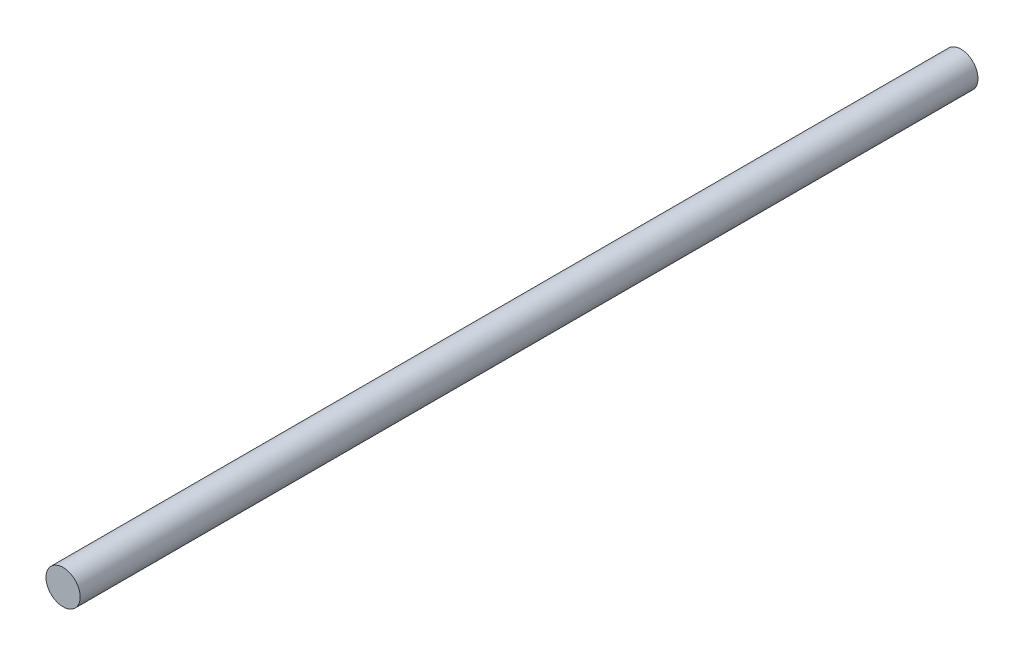
ISO-10303-21;
HEADER;
FILE_DESCRIPTION(('STEP AP214'),'2;1');
FILE_NAME('part.step','',(''),(''),'','','');
FILE_SCHEMA(('AUTOMOTIVE_DESIGN { 1 0 10303 214 1 1 1 1 }'));
ENDSEC;
DATA;
#1=APPLICATION_CONTEXT('core data for automotive mechanical design processes');
#2=APPLICATION_PROTOCOL_DEFINITION('international standard','automotive_design',2000,#1);
#3=PRODUCT_CONTEXT('',#1,'mechanical');
#4=PRODUCT('Part','Part','',(#3));
#5=PRODUCT_RELATED_PRODUCT_CATEGORY('part','',(#4));
#6=PRODUCT_DEFINITION_FORMATION('','',#4);
#7=PRODUCT_DEFINITION_CONTEXT('part definition',#1,'design');
#8=PRODUCT_DEFINITION('design','',#6,#7);
#9=PRODUCT_DEFINITION_SHAPE('','',#8);
#10=(LENGTH_UNIT() NAMED_UNIT(*) SI_UNIT(.MILLI.,.METRE.));
#11=(NAMED_UNIT(*) PLANE_ANGLE_UNIT() SI_UNIT($,.RADIAN.));
#12=(NAMED_UNIT(*) SI_UNIT($,.STERADIAN.) SOLID_ANGLE_UNIT());
#13=UNCERTAINTY_MEASURE_WITH_UNIT(LENGTH_MEASURE(1.E-05),#10,'distance_accuracy_value','');
#14=(GEOMETRIC_REPRESENTATION_CONTEXT(3) GLOBAL_UNCERTAINTY_ASSIGNED_CONTEXT((#13)) GLOBAL_UNIT_ASSIGNED_CONTEXT((#10,
#11,#12)) REPRESENTATION_CONTEXT('',''));
#15=CARTESIAN_POINT('',(0.,0.,0.));
#16=DIRECTION('',(0.,0.,1.));
#17=DIRECTION('',(1.,0.,0.));
#18=AXIS2_PLACEMENT_3D('',#15,#16,#17);
#19=CARTESIAN_POINT('',(0.,0.,210.));
#20=DIRECTION('',(0.,0.,-1.));
#21=DIRECTION('',(-1.,0.,0.));
#22=AXIS2_PLACEMENT_3D('',#19,#20,#21);
#23=CYLINDRICAL_SURFACE('',#22,4.);
#24=CARTESIAN_POINT('',(0.,0.,210.));
#25=DIRECTION('',(0.,0.,1.));
#26=DIRECTION('',(1.,0.,0.));
#27=AXIS2_PLACEMENT_3D('',#24,#25,#26);
#28=CIRCLE('',#27,4.);
#29=CARTESIAN_POINT('',(4.,0.,210.));
#30=VERTEX_POINT('',#29);
#31=EDGE_CURVE('E10',#30,#30,#28,.T.);
#32=ORIENTED_EDGE('',*,*,#31,.F.);
#33=EDGE_LOOP('',(#32));
#34=FACE_BOUND('',#33,.T.);
#35=CARTESIAN_POINT('',(0.,0.,0.));
#36=DIRECTION('',(0.,0.,1.));
#37=DIRECTION('',(1.,0.,0.));
#38=AXIS2_PLACEMENT_3D('',#35,#36,#37);
#39=CIRCLE('',#38,4.);
#40=CARTESIAN_POINT('',(4.,0.,0.));
#41=VERTEX_POINT('',#40);
#42=EDGE_CURVE('E41',#41,#41,#39,.T.);
#43=ORIENTED_EDGE('',*,*,#42,.T.);
#44=EDGE_LOOP('',(#43));
#45=FACE_BOUND('',#44,.T.);
#46=ADVANCED_FACE('F38',(#34,#45),#23,.T.);
#47=CARTESIAN_POINT('',(0.,0.,210.));
#48=DIRECTION('',(0.,0.,1.));
#49=DIRECTION('',(1.,0.,0.));
#50=AXIS2_PLACEMENT_3D('',#47,#48,#49);
#51=PLANE('',#50);
#52=ORIENTED_EDGE('',*,*,#31,.T.);
#53=EDGE_LOOP('',(#52));
#54=FACE_BOUND('',#53,.T.);
#55=ADVANCED_FACE('F55',(#54),#51,.T.);
#56=CARTESIAN_POINT('',(0.,0.,0.));
#57=DIRECTION('',(0.,0.,1.));
#58=DIRECTION('',(1.,0.,0.));
#59=AXIS2_PLACEMENT_3D('',#56,#57,#58);
#60=PLANE('',#59);
#61=ORIENTED_EDGE('',*,*,#42,.F.);
#62=EDGE_LOOP('',(#61));
#63=FACE_BOUND('',#62,.T.);
#64=ADVANCED_FACE('F53',(#63),#60,.F.);
#65=CLOSED_SHELL('',(#46,#55,#64));
#66=MANIFOLD_SOLID_BREP('B2',#65);
#67=ADVANCED_BREP_SHAPE_REPRESENTATION('',(#18,#66),#14);
#68=SHAPE_DEFINITION_REPRESENTATION(#9,#67);
ENDSEC;
END-ISO-10303-21;
